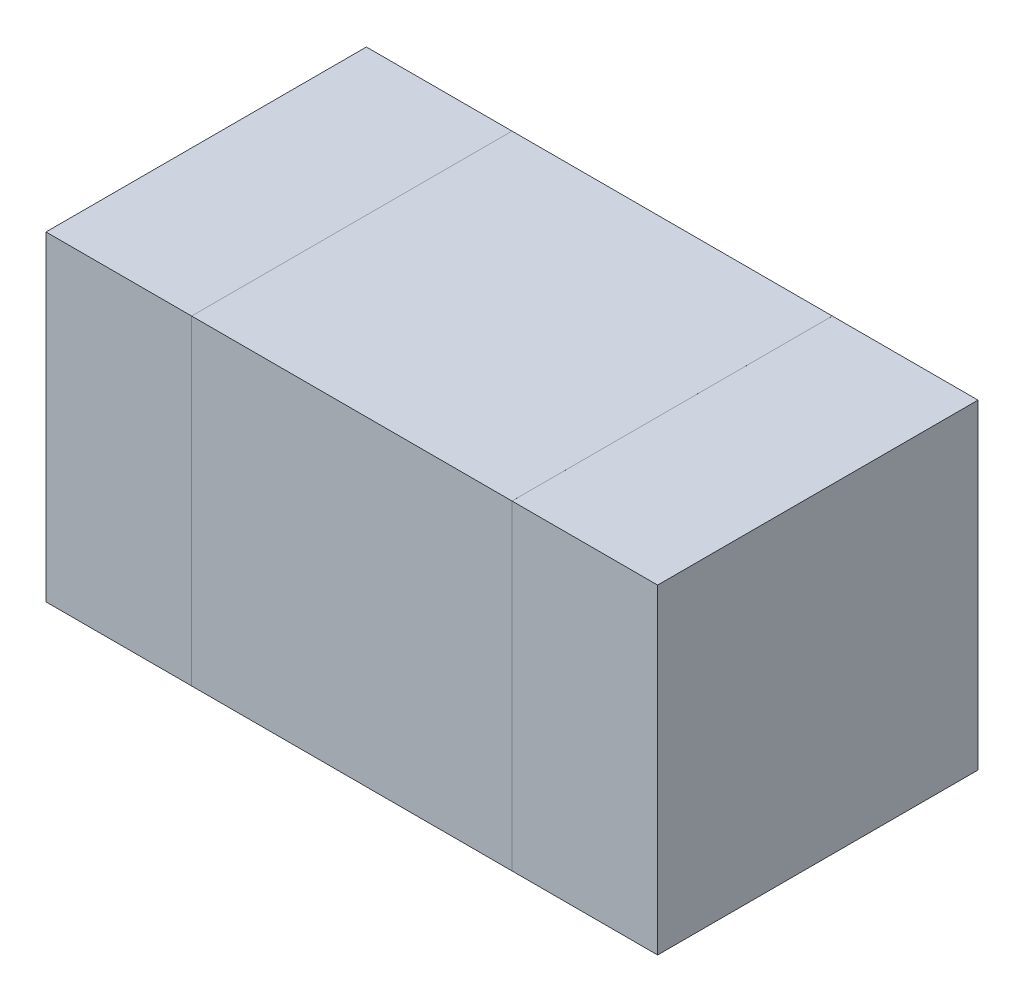
ISO-10303-21;
HEADER;
FILE_DESCRIPTION(('STEP AP214'),'2;1');
FILE_NAME('part.step','',(''),(''),'','','');
FILE_SCHEMA(('AUTOMOTIVE_DESIGN { 1 0 10303 214 1 1 1 1 }'));
ENDSEC;
DATA;
#1=APPLICATION_CONTEXT('core data for automotive mechanical design processes');
#2=APPLICATION_PROTOCOL_DEFINITION('international standard','automotive_design',2000,#1);
#3=PRODUCT_CONTEXT('',#1,'mechanical');
#4=PRODUCT('Part','Part','',(#3));
#5=PRODUCT_RELATED_PRODUCT_CATEGORY('part','',(#4));
#6=PRODUCT_DEFINITION_FORMATION('','',#4);
#7=PRODUCT_DEFINITION_CONTEXT('part definition',#1,'design');
#8=PRODUCT_DEFINITION('design','',#6,#7);
#9=PRODUCT_DEFINITION_SHAPE('','',#8);
#10=(LENGTH_UNIT() NAMED_UNIT(*) SI_UNIT(.MILLI.,.METRE.));
#11=(NAMED_UNIT(*) PLANE_ANGLE_UNIT() SI_UNIT($,.RADIAN.));
#12=(NAMED_UNIT(*) SI_UNIT($,.STERADIAN.) SOLID_ANGLE_UNIT());
#13=UNCERTAINTY_MEASURE_WITH_UNIT(LENGTH_MEASURE(1.E-05),#10,'distance_accuracy_value','');
#14=(GEOMETRIC_REPRESENTATION_CONTEXT(3) GLOBAL_UNCERTAINTY_ASSIGNED_CONTEXT((#13)) GLOBAL_UNIT_ASSIGNED_CONTEXT((#10,
#11,#12)) REPRESENTATION_CONTEXT('',''));
#15=CARTESIAN_POINT('',(0.,0.,0.));
#16=DIRECTION('',(0.,0.,1.));
#17=DIRECTION('',(1.,0.,0.));
#18=AXIS2_PLACEMENT_3D('',#15,#16,#17);
#19=CARTESIAN_POINT('',(4.359994025938,13.75999385668,0.32999934));
#20=DIRECTION('',(0.,0.,-1.));
#21=DIRECTION('',(0.,-1.,0.));
#22=AXIS2_PLACEMENT_3D('',#19,#20,#21);
#23=PLANE('',#22);
#24=DIRECTION('',(1.,0.,0.));
#25=VECTOR('',#24,1.);
#26=CARTESIAN_POINT('',(4.359994025938,13.75999385668,0.32999934));
#27=LINE('',#26,#25);
#28=CARTESIAN_POINT('',(4.359994025938,13.75999385668,0.32999934));
#29=VERTEX_POINT('',#28);
#30=CARTESIAN_POINT('',(4.689995905938,13.75999385668,0.32999934));
#31=VERTEX_POINT('',#30);
#32=EDGE_CURVE('P0_E94',#29,#31,#27,.T.);
#33=ORIENTED_EDGE('',*,*,#32,.T.);
#34=DIRECTION('',(0.,1.,0.));
#35=VECTOR('',#34,1.);
#36=CARTESIAN_POINT('',(4.689995905938,13.75999385668,0.32999934));
#37=LINE('',#36,#35);
#38=CARTESIAN_POINT('',(4.689995905938,14.08999319668,0.32999934));
#39=VERTEX_POINT('',#38);
#40=EDGE_CURVE('P0_E75',#31,#39,#37,.T.);
#41=ORIENTED_EDGE('',*,*,#40,.T.);
#42=DIRECTION('',(-1.,0.,0.));
#43=VECTOR('',#42,1.);
#44=CARTESIAN_POINT('',(4.689995905938,14.08999319668,0.32999934));
#45=LINE('',#44,#43);
#46=CARTESIAN_POINT('',(4.359994025938,14.08999319668,0.32999934));
#47=VERTEX_POINT('',#46);
#48=EDGE_CURVE('P0_E21',#39,#47,#45,.T.);
#49=ORIENTED_EDGE('',*,*,#48,.T.);
#50=DIRECTION('',(0.,-1.,0.));
#51=VECTOR('',#50,1.);
#52=CARTESIAN_POINT('',(4.359994025938,14.08999319668,0.32999934));
#53=LINE('',#52,#51);
#54=EDGE_CURVE('P0_E11',#47,#29,#53,.T.);
#55=ORIENTED_EDGE('',*,*,#54,.T.);
#56=EDGE_LOOP('',(#33,#41,#49,#55));
#57=FACE_BOUND('',#56,.T.);
#58=ADVANCED_FACE('P0_F17',(#57),#23,.F.);
#59=CARTESIAN_POINT('',(4.359994025938,13.75999385668,0.));
#60=DIRECTION('',(0.,0.,-1.));
#61=DIRECTION('',(0.,-1.,0.));
#62=AXIS2_PLACEMENT_3D('',#59,#60,#61);
#63=PLANE('',#62);
#64=DIRECTION('',(0.,-1.,0.));
#65=VECTOR('',#64,1.);
#66=CARTESIAN_POINT('',(4.359994025938,14.08999319668,0.));
#67=LINE('',#66,#65);
#68=CARTESIAN_POINT('',(4.359994025938,14.08999319668,0.));
#69=VERTEX_POINT('',#68);
#70=CARTESIAN_POINT('',(4.359994025938,13.75999385668,0.));
#71=VERTEX_POINT('',#70);
#72=EDGE_CURVE('P0_E27',#69,#71,#67,.T.);
#73=ORIENTED_EDGE('',*,*,#72,.F.);
#74=DIRECTION('',(-1.,0.,0.));
#75=VECTOR('',#74,1.);
#76=CARTESIAN_POINT('',(4.689995905938,14.08999319668,0.));
#77=LINE('',#76,#75);
#78=CARTESIAN_POINT('',(4.689995905938,14.08999319668,0.));
#79=VERTEX_POINT('',#78);
#80=EDGE_CURVE('P0_E60',#79,#69,#77,.T.);
#81=ORIENTED_EDGE('',*,*,#80,.F.);
#82=DIRECTION('',(0.,1.,0.));
#83=VECTOR('',#82,1.);
#84=CARTESIAN_POINT('',(4.689995905938,13.75999385668,0.));
#85=LINE('',#84,#83);
#86=CARTESIAN_POINT('',(4.689995905938,13.75999385668,0.));
#87=VERTEX_POINT('',#86);
#88=EDGE_CURVE('P0_E96',#87,#79,#85,.T.);
#89=ORIENTED_EDGE('',*,*,#88,.F.);
#90=DIRECTION('',(1.,0.,0.));
#91=VECTOR('',#90,1.);
#92=CARTESIAN_POINT('',(4.359994025938,13.75999385668,0.));
#93=LINE('',#92,#91);
#94=EDGE_CURVE('P0_E93',#71,#87,#93,.T.);
#95=ORIENTED_EDGE('',*,*,#94,.F.);
#96=EDGE_LOOP('',(#73,#81,#89,#95));
#97=FACE_BOUND('',#96,.T.);
#98=ADVANCED_FACE('P0_F19',(#97),#63,.T.);
#99=CARTESIAN_POINT('',(4.359994025938,14.08999319668,0.));
#100=DIRECTION('',(1.,0.,0.));
#101=DIRECTION('',(0.,1.,0.));
#102=AXIS2_PLACEMENT_3D('',#99,#100,#101);
#103=PLANE('',#102);
#104=ORIENTED_EDGE('',*,*,#72,.T.);
#105=DIRECTION('',(0.,0.,1.));
#106=VECTOR('',#105,1.);
#107=CARTESIAN_POINT('',(4.359994025938,13.75999385668,0.));
#108=LINE('',#107,#106);
#109=EDGE_CURVE('P0_E83',#71,#29,#108,.T.);
#110=ORIENTED_EDGE('',*,*,#109,.T.);
#111=ORIENTED_EDGE('',*,*,#54,.F.);
#112=DIRECTION('',(0.,0.,1.));
#113=VECTOR('',#112,1.);
#114=CARTESIAN_POINT('',(4.359994025938,14.08999319668,0.));
#115=LINE('',#114,#113);
#116=EDGE_CURVE('P0_E86',#69,#47,#115,.T.);
#117=ORIENTED_EDGE('',*,*,#116,.F.);
#118=EDGE_LOOP('',(#104,#110,#111,#117));
#119=FACE_BOUND('',#118,.T.);
#120=ADVANCED_FACE('P0_F82',(#119),#103,.F.);
#121=CARTESIAN_POINT('',(4.689995905938,14.08999319668,0.));
#122=DIRECTION('',(0.,-1.,0.));
#123=DIRECTION('',(0.,0.,-1.));
#124=AXIS2_PLACEMENT_3D('',#121,#122,#123);
#125=PLANE('',#124);
#126=ORIENTED_EDGE('',*,*,#80,.T.);
#127=ORIENTED_EDGE('',*,*,#116,.T.);
#128=ORIENTED_EDGE('',*,*,#48,.F.);
#129=DIRECTION('',(0.,0.,1.));
#130=VECTOR('',#129,1.);
#131=CARTESIAN_POINT('',(4.689995905938,14.08999319668,0.));
#132=LINE('',#131,#130);
#133=EDGE_CURVE('P0_E106',#79,#39,#132,.T.);
#134=ORIENTED_EDGE('',*,*,#133,.F.);
#135=EDGE_LOOP('',(#126,#127,#128,#134));
#136=FACE_BOUND('',#135,.T.);
#137=ADVANCED_FACE('P0_F122',(#136),#125,.F.);
#138=CARTESIAN_POINT('',(4.689995905938,13.75999385668,0.));
#139=DIRECTION('',(-1.,0.,0.));
#140=DIRECTION('',(0.,0.,1.));
#141=AXIS2_PLACEMENT_3D('',#138,#139,#140);
#142=PLANE('',#141);
#143=ORIENTED_EDGE('',*,*,#88,.T.);
#144=ORIENTED_EDGE('',*,*,#133,.T.);
#145=ORIENTED_EDGE('',*,*,#40,.F.);
#146=DIRECTION('',(0.,0.,1.));
#147=VECTOR('',#146,1.);
#148=CARTESIAN_POINT('',(4.689995905938,13.75999385668,0.));
#149=LINE('',#148,#147);
#150=EDGE_CURVE('P0_E100',#87,#31,#149,.T.);
#151=ORIENTED_EDGE('',*,*,#150,.F.);
#152=EDGE_LOOP('',(#143,#144,#145,#151));
#153=FACE_BOUND('',#152,.T.);
#154=ADVANCED_FACE('P0_F123',(#153),#142,.F.);
#155=CARTESIAN_POINT('',(4.359994025938,13.75999385668,0.));
#156=DIRECTION('',(0.,1.,0.));
#157=DIRECTION('',(1.,0.,0.));
#158=AXIS2_PLACEMENT_3D('',#155,#156,#157);
#159=PLANE('',#158);
#160=ORIENTED_EDGE('',*,*,#94,.T.);
#161=ORIENTED_EDGE('',*,*,#150,.T.);
#162=ORIENTED_EDGE('',*,*,#32,.F.);
#163=ORIENTED_EDGE('',*,*,#109,.F.);
#164=EDGE_LOOP('',(#160,#161,#162,#163));
#165=FACE_BOUND('',#164,.T.);
#166=ADVANCED_FACE('P0_F91',(#165),#159,.F.);
#167=CLOSED_SHELL('',(#58,#98,#120,#137,#154,#166));
#168=MANIFOLD_SOLID_BREP('P0_B1',#167);
#169=CARTESIAN_POINT('',(4.840001579102,13.75999131668,0.32999934));
#170=DIRECTION('',(0.,0.,-1.));
#171=DIRECTION('',(0.,-1.,0.));
#172=AXIS2_PLACEMENT_3D('',#169,#170,#171);
#173=PLANE('',#172);
#174=DIRECTION('',(0.,1.,0.));
#175=VECTOR('',#174,1.);
#176=CARTESIAN_POINT('',(4.840001579102,13.75999131668,0.32999934));
#177=LINE('',#176,#175);
#178=CARTESIAN_POINT('',(4.840001579102,13.75999131668,0.32999934));
#179=VERTEX_POINT('',#178);
#180=CARTESIAN_POINT('',(4.840001579102,14.08999319668,0.32999934));
#181=VERTEX_POINT('',#180);
#182=EDGE_CURVE('P1_E73',#179,#181,#177,.T.);
#183=ORIENTED_EDGE('',*,*,#182,.T.);
#184=DIRECTION('',(-1.,0.,0.));
#185=VECTOR('',#184,1.);
#186=CARTESIAN_POINT('',(4.840001579102,14.08999319668,0.32999934));
#187=LINE('',#186,#185);
#188=CARTESIAN_POINT('',(4.689999339102,14.08999319668,0.32999934));
#189=VERTEX_POINT('',#188);
#190=EDGE_CURVE('P1_E71',#181,#189,#187,.T.);
#191=ORIENTED_EDGE('',*,*,#190,.T.);
#192=DIRECTION('',(0.,-1.,0.));
#193=VECTOR('',#192,1.);
#194=CARTESIAN_POINT('',(4.689999339102,14.08999319668,0.32999934));
#195=LINE('',#194,#193);
#196=CARTESIAN_POINT('',(4.689999339102,13.75999131668,0.32999934));
#197=VERTEX_POINT('',#196);
#198=EDGE_CURVE('P1_E60',#189,#197,#195,.T.);
#199=ORIENTED_EDGE('',*,*,#198,.T.);
#200=DIRECTION('',(1.,0.,0.));
#201=VECTOR('',#200,1.);
#202=CARTESIAN_POINT('',(4.689999339102,13.75999131668,0.32999934));
#203=LINE('',#202,#201);
#204=EDGE_CURVE('P1_E11',#197,#179,#203,.T.);
#205=ORIENTED_EDGE('',*,*,#204,.T.);
#206=EDGE_LOOP('',(#183,#191,#199,#205));
#207=FACE_BOUND('',#206,.T.);
#208=ADVANCED_FACE('P1_F17',(#207),#173,.F.);
#209=CARTESIAN_POINT('',(4.840001579102,13.75999131668,0.));
#210=DIRECTION('',(0.,0.,-1.));
#211=DIRECTION('',(0.,-1.,0.));
#212=AXIS2_PLACEMENT_3D('',#209,#210,#211);
#213=PLANE('',#212);
#214=DIRECTION('',(1.,0.,0.));
#215=VECTOR('',#214,1.);
#216=CARTESIAN_POINT('',(4.689999339102,13.75999131668,0.));
#217=LINE('',#216,#215);
#218=CARTESIAN_POINT('',(4.689999339102,13.75999131668,0.));
#219=VERTEX_POINT('',#218);
#220=CARTESIAN_POINT('',(4.840001579102,13.75999131668,0.));
#221=VERTEX_POINT('',#220);
#222=EDGE_CURVE('P1_E27',#219,#221,#217,.T.);
#223=ORIENTED_EDGE('',*,*,#222,.F.);
#224=DIRECTION('',(0.,-1.,0.));
#225=VECTOR('',#224,1.);
#226=CARTESIAN_POINT('',(4.689999339102,14.08999319668,0.));
#227=LINE('',#226,#225);
#228=CARTESIAN_POINT('',(4.689999339102,14.08999319668,0.));
#229=VERTEX_POINT('',#228);
#230=EDGE_CURVE('P1_E78',#229,#219,#227,.T.);
#231=ORIENTED_EDGE('',*,*,#230,.F.);
#232=DIRECTION('',(-1.,0.,0.));
#233=VECTOR('',#232,1.);
#234=CARTESIAN_POINT('',(4.840001579102,14.08999319668,0.));
#235=LINE('',#234,#233);
#236=CARTESIAN_POINT('',(4.840001579102,14.08999319668,0.));
#237=VERTEX_POINT('',#236);
#238=EDGE_CURVE('P1_E82',#237,#229,#235,.T.);
#239=ORIENTED_EDGE('',*,*,#238,.F.);
#240=DIRECTION('',(0.,1.,0.));
#241=VECTOR('',#240,1.);
#242=CARTESIAN_POINT('',(4.840001579102,13.75999131668,0.));
#243=LINE('',#242,#241);
#244=EDGE_CURVE('P1_E145',#221,#237,#243,.T.);
#245=ORIENTED_EDGE('',*,*,#244,.F.);
#246=EDGE_LOOP('',(#223,#231,#239,#245));
#247=FACE_BOUND('',#246,.T.);
#248=ADVANCED_FACE('P1_F122',(#247),#213,.T.);
#249=CARTESIAN_POINT('',(4.689999339102,13.75999131668,0.));
#250=DIRECTION('',(0.,1.,0.));
#251=DIRECTION('',(1.,0.,0.));
#252=AXIS2_PLACEMENT_3D('',#249,#250,#251);
#253=PLANE('',#252);
#254=ORIENTED_EDGE('',*,*,#222,.T.);
#255=DIRECTION('',(0.,0.,1.));
#256=VECTOR('',#255,1.);
#257=CARTESIAN_POINT('',(4.840001579102,13.75999131668,0.));
#258=LINE('',#257,#256);
#259=EDGE_CURVE('P1_E88',#221,#179,#258,.T.);
#260=ORIENTED_EDGE('',*,*,#259,.T.);
#261=ORIENTED_EDGE('',*,*,#204,.F.);
#262=DIRECTION('',(0.,0.,1.));
#263=VECTOR('',#262,1.);
#264=CARTESIAN_POINT('',(4.689999339102,13.75999131668,0.));
#265=LINE('',#264,#263);
#266=EDGE_CURVE('P1_E20',#219,#197,#265,.T.);
#267=ORIENTED_EDGE('',*,*,#266,.F.);
#268=EDGE_LOOP('',(#254,#260,#261,#267));
#269=FACE_BOUND('',#268,.T.);
#270=ADVANCED_FACE('P1_F115',(#269),#253,.F.);
#271=CARTESIAN_POINT('',(4.689999339102,14.08999319668,0.));
#272=DIRECTION('',(1.,0.,0.));
#273=DIRECTION('',(0.,1.,0.));
#274=AXIS2_PLACEMENT_3D('',#271,#272,#273);
#275=PLANE('',#274);
#276=ORIENTED_EDGE('',*,*,#230,.T.);
#277=ORIENTED_EDGE('',*,*,#266,.T.);
#278=ORIENTED_EDGE('',*,*,#198,.F.);
#279=DIRECTION('',(0.,0.,1.));
#280=VECTOR('',#279,1.);
#281=CARTESIAN_POINT('',(4.689999339102,14.08999319668,0.));
#282=LINE('',#281,#280);
#283=EDGE_CURVE('P1_E65',#229,#189,#282,.T.);
#284=ORIENTED_EDGE('',*,*,#283,.F.);
#285=EDGE_LOOP('',(#276,#277,#278,#284));
#286=FACE_BOUND('',#285,.T.);
#287=ADVANCED_FACE('P1_F63',(#286),#275,.F.);
#288=CARTESIAN_POINT('',(4.840001579102,14.08999319668,0.));
#289=DIRECTION('',(0.,-1.,0.));
#290=DIRECTION('',(0.,0.,-1.));
#291=AXIS2_PLACEMENT_3D('',#288,#289,#290);
#292=PLANE('',#291);
#293=ORIENTED_EDGE('',*,*,#238,.T.);
#294=ORIENTED_EDGE('',*,*,#283,.T.);
#295=ORIENTED_EDGE('',*,*,#190,.F.);
#296=DIRECTION('',(0.,0.,1.));
#297=VECTOR('',#296,1.);
#298=CARTESIAN_POINT('',(4.840001579102,14.08999319668,0.));
#299=LINE('',#298,#297);
#300=EDGE_CURVE('P1_E146',#237,#181,#299,.T.);
#301=ORIENTED_EDGE('',*,*,#300,.F.);
#302=EDGE_LOOP('',(#293,#294,#295,#301));
#303=FACE_BOUND('',#302,.T.);
#304=ADVANCED_FACE('P1_F80',(#303),#292,.F.);
#305=CARTESIAN_POINT('',(4.840001579102,13.75999131668,0.));
#306=DIRECTION('',(-1.,0.,0.));
#307=DIRECTION('',(0.,0.,1.));
#308=AXIS2_PLACEMENT_3D('',#305,#306,#307);
#309=PLANE('',#308);
#310=ORIENTED_EDGE('',*,*,#244,.T.);
#311=ORIENTED_EDGE('',*,*,#300,.T.);
#312=ORIENTED_EDGE('',*,*,#182,.F.);
#313=ORIENTED_EDGE('',*,*,#259,.F.);
#314=EDGE_LOOP('',(#310,#311,#312,#313));
#315=FACE_BOUND('',#314,.T.);
#316=ADVANCED_FACE('P1_F96',(#315),#309,.F.);
#317=CLOSED_SHELL('',(#208,#248,#270,#287,#304,#316));
#318=MANIFOLD_SOLID_BREP('P1_B1',#317);
#319=CARTESIAN_POINT('',(4.360005851563,13.75999131668,0.32999934));
#320=DIRECTION('',(0.,0.,-1.));
#321=DIRECTION('',(0.,-1.,0.));
#322=AXIS2_PLACEMENT_3D('',#319,#320,#321);
#323=PLANE('',#322);
#324=DIRECTION('',(0.,1.,0.));
#325=VECTOR('',#324,1.);
#326=CARTESIAN_POINT('',(4.360005851563,13.75999131668,0.32999934));
#327=LINE('',#326,#325);
#328=CARTESIAN_POINT('',(4.360005851563,13.75999131668,0.32999934));
#329=VERTEX_POINT('',#328);
#330=CARTESIAN_POINT('',(4.360005851563,14.08999319668,0.32999934));
#331=VERTEX_POINT('',#330);
#332=EDGE_CURVE('P2_E87',#329,#331,#327,.T.);
#333=ORIENTED_EDGE('',*,*,#332,.T.);
#334=DIRECTION('',(-1.,0.,0.));
#335=VECTOR('',#334,1.);
#336=CARTESIAN_POINT('',(4.360005851563,14.08999319668,0.32999934));
#337=LINE('',#336,#335);
#338=CARTESIAN_POINT('',(4.210003611563,14.08999319668,0.32999934));
#339=VERTEX_POINT('',#338);
#340=EDGE_CURVE('P2_E109',#331,#339,#337,.T.);
#341=ORIENTED_EDGE('',*,*,#340,.T.);
#342=DIRECTION('',(0.,-1.,0.));
#343=VECTOR('',#342,1.);
#344=CARTESIAN_POINT('',(4.210003611563,14.08999319668,0.32999934));
#345=LINE('',#344,#343);
#346=CARTESIAN_POINT('',(4.210003611563,13.75999131668,0.32999934));
#347=VERTEX_POINT('',#346);
#348=EDGE_CURVE('P2_E80',#339,#347,#345,.T.);
#349=ORIENTED_EDGE('',*,*,#348,.T.);
#350=DIRECTION('',(1.,0.,0.));
#351=VECTOR('',#350,1.);
#352=CARTESIAN_POINT('',(4.210003611563,13.75999131668,0.32999934));
#353=LINE('',#352,#351);
#354=EDGE_CURVE('P2_E11',#347,#329,#353,.T.);
#355=ORIENTED_EDGE('',*,*,#354,.T.);
#356=EDGE_LOOP('',(#333,#341,#349,#355));
#357=FACE_BOUND('',#356,.T.);
#358=ADVANCED_FACE('P2_F17',(#357),#323,.F.);
#359=CARTESIAN_POINT('',(4.360005851563,13.75999131668,0.));
#360=DIRECTION('',(0.,0.,-1.));
#361=DIRECTION('',(0.,-1.,0.));
#362=AXIS2_PLACEMENT_3D('',#359,#360,#361);
#363=PLANE('',#362);
#364=DIRECTION('',(1.,0.,0.));
#365=VECTOR('',#364,1.);
#366=CARTESIAN_POINT('',(4.210003611563,13.75999131668,0.));
#367=LINE('',#366,#365);
#368=CARTESIAN_POINT('',(4.210003611563,13.75999131668,0.));
#369=VERTEX_POINT('',#368);
#370=CARTESIAN_POINT('',(4.360005851563,13.75999131668,0.));
#371=VERTEX_POINT('',#370);
#372=EDGE_CURVE('P2_E25',#369,#371,#367,.T.);
#373=ORIENTED_EDGE('',*,*,#372,.F.);
#374=DIRECTION('',(0.,-1.,0.));
#375=VECTOR('',#374,1.);
#376=CARTESIAN_POINT('',(4.210003611563,14.08999319668,0.));
#377=LINE('',#376,#375);
#378=CARTESIAN_POINT('',(4.210003611563,14.08999319668,0.));
#379=VERTEX_POINT('',#378);
#380=EDGE_CURVE('P2_E58',#379,#369,#377,.T.);
#381=ORIENTED_EDGE('',*,*,#380,.F.);
#382=DIRECTION('',(-1.,0.,0.));
#383=VECTOR('',#382,1.);
#384=CARTESIAN_POINT('',(4.360005851563,14.08999319668,0.));
#385=LINE('',#384,#383);
#386=CARTESIAN_POINT('',(4.360005851563,14.08999319668,0.));
#387=VERTEX_POINT('',#386);
#388=EDGE_CURVE('P2_E89',#387,#379,#385,.T.);
#389=ORIENTED_EDGE('',*,*,#388,.F.);
#390=DIRECTION('',(0.,1.,0.));
#391=VECTOR('',#390,1.);
#392=CARTESIAN_POINT('',(4.360005851563,13.75999131668,0.));
#393=LINE('',#392,#391);
#394=EDGE_CURVE('P2_E86',#371,#387,#393,.T.);
#395=ORIENTED_EDGE('',*,*,#394,.F.);
#396=EDGE_LOOP('',(#373,#381,#389,#395));
#397=FACE_BOUND('',#396,.T.);
#398=ADVANCED_FACE('P2_F91',(#397),#363,.T.);
#399=CARTESIAN_POINT('',(4.210003611563,13.75999131668,0.));
#400=DIRECTION('',(0.,1.,0.));
#401=DIRECTION('',(1.,0.,0.));
#402=AXIS2_PLACEMENT_3D('',#399,#400,#401);
#403=PLANE('',#402);
#404=ORIENTED_EDGE('',*,*,#372,.T.);
#405=DIRECTION('',(0.,0.,1.));
#406=VECTOR('',#405,1.);
#407=CARTESIAN_POINT('',(4.360005851563,13.75999131668,0.));
#408=LINE('',#407,#406);
#409=EDGE_CURVE('P2_E75',#371,#329,#408,.T.);
#410=ORIENTED_EDGE('',*,*,#409,.T.);
#411=ORIENTED_EDGE('',*,*,#354,.F.);
#412=DIRECTION('',(0.,0.,1.));
#413=VECTOR('',#412,1.);
#414=CARTESIAN_POINT('',(4.210003611563,13.75999131668,0.));
#415=LINE('',#414,#413);
#416=EDGE_CURVE('P2_E78',#369,#347,#415,.T.);
#417=ORIENTED_EDGE('',*,*,#416,.F.);
#418=EDGE_LOOP('',(#404,#410,#411,#417));
#419=FACE_BOUND('',#418,.T.);
#420=ADVANCED_FACE('P2_F74',(#419),#403,.F.);
#421=CARTESIAN_POINT('',(4.210003611563,14.08999319668,0.));
#422=DIRECTION('',(1.,0.,0.));
#423=DIRECTION('',(0.,1.,0.));
#424=AXIS2_PLACEMENT_3D('',#421,#422,#423);
#425=PLANE('',#424);
#426=ORIENTED_EDGE('',*,*,#380,.T.);
#427=ORIENTED_EDGE('',*,*,#416,.T.);
#428=ORIENTED_EDGE('',*,*,#348,.F.);
#429=DIRECTION('',(0.,0.,1.));
#430=VECTOR('',#429,1.);
#431=CARTESIAN_POINT('',(4.210003611563,14.08999319668,0.));
#432=LINE('',#431,#430);
#433=EDGE_CURVE('P2_E105',#379,#339,#432,.T.);
#434=ORIENTED_EDGE('',*,*,#433,.F.);
#435=EDGE_LOOP('',(#426,#427,#428,#434));
#436=FACE_BOUND('',#435,.T.);
#437=ADVANCED_FACE('P2_F119',(#436),#425,.F.);
#438=CARTESIAN_POINT('',(4.360005851563,14.08999319668,0.));
#439=DIRECTION('',(0.,-1.,0.));
#440=DIRECTION('',(0.,0.,-1.));
#441=AXIS2_PLACEMENT_3D('',#438,#439,#440);
#442=PLANE('',#441);
#443=ORIENTED_EDGE('',*,*,#388,.T.);
#444=ORIENTED_EDGE('',*,*,#433,.T.);
#445=ORIENTED_EDGE('',*,*,#340,.F.);
#446=DIRECTION('',(0.,0.,1.));
#447=VECTOR('',#446,1.);
#448=CARTESIAN_POINT('',(4.360005851563,14.08999319668,0.));
#449=LINE('',#448,#447);
#450=EDGE_CURVE('P2_E95',#387,#331,#449,.T.);
#451=ORIENTED_EDGE('',*,*,#450,.F.);
#452=EDGE_LOOP('',(#443,#444,#445,#451));
#453=FACE_BOUND('',#452,.T.);
#454=ADVANCED_FACE('P2_F121',(#453),#442,.F.);
#455=CARTESIAN_POINT('',(4.360005851563,13.75999131668,0.));
#456=DIRECTION('',(-1.,0.,0.));
#457=DIRECTION('',(0.,0.,1.));
#458=AXIS2_PLACEMENT_3D('',#455,#456,#457);
#459=PLANE('',#458);
#460=ORIENTED_EDGE('',*,*,#394,.T.);
#461=ORIENTED_EDGE('',*,*,#450,.T.);
#462=ORIENTED_EDGE('',*,*,#332,.F.);
#463=ORIENTED_EDGE('',*,*,#409,.F.);
#464=EDGE_LOOP('',(#460,#461,#462,#463));
#465=FACE_BOUND('',#464,.T.);
#466=ADVANCED_FACE('P2_F84',(#465),#459,.F.);
#467=CLOSED_SHELL('',(#358,#398,#420,#437,#454,#466));
#468=MANIFOLD_SOLID_BREP('P2_B1',#467);
#469=ADVANCED_BREP_SHAPE_REPRESENTATION('',(#18,#168,#318,#468),#14);
#470=SHAPE_DEFINITION_REPRESENTATION(#9,#469);
ENDSEC;
END-ISO-10303-21;
